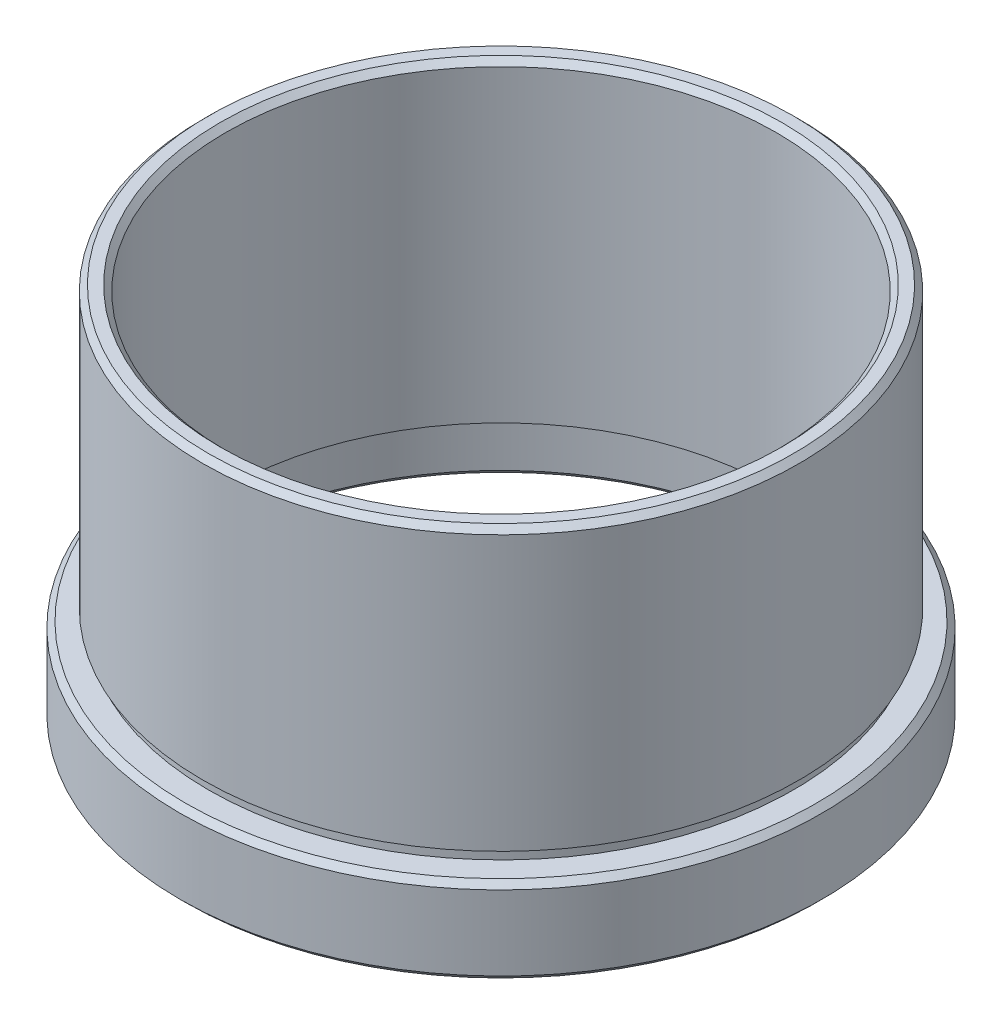
ISO-10303-21;
HEADER;
FILE_DESCRIPTION(('STEP AP214'),'2;1');
FILE_NAME('part.step','',(''),(''),'','','');
FILE_SCHEMA(('AUTOMOTIVE_DESIGN { 1 0 10303 214 1 1 1 1 }'));
ENDSEC;
DATA;
#1=APPLICATION_CONTEXT('core data for automotive mechanical design processes');
#2=APPLICATION_PROTOCOL_DEFINITION('international standard','automotive_design',2000,#1);
#3=PRODUCT_CONTEXT('',#1,'mechanical');
#4=PRODUCT('Part','Part','',(#3));
#5=PRODUCT_RELATED_PRODUCT_CATEGORY('part','',(#4));
#6=PRODUCT_DEFINITION_FORMATION('','',#4);
#7=PRODUCT_DEFINITION_CONTEXT('part definition',#1,'design');
#8=PRODUCT_DEFINITION('design','',#6,#7);
#9=PRODUCT_DEFINITION_SHAPE('','',#8);
#10=(LENGTH_UNIT() NAMED_UNIT(*) SI_UNIT(.MILLI.,.METRE.));
#11=(NAMED_UNIT(*) PLANE_ANGLE_UNIT() SI_UNIT($,.RADIAN.));
#12=(NAMED_UNIT(*) SI_UNIT($,.STERADIAN.) SOLID_ANGLE_UNIT());
#13=UNCERTAINTY_MEASURE_WITH_UNIT(LENGTH_MEASURE(1.E-05),#10,'distance_accuracy_value','');
#14=(GEOMETRIC_REPRESENTATION_CONTEXT(3) GLOBAL_UNCERTAINTY_ASSIGNED_CONTEXT((#13)) GLOBAL_UNIT_ASSIGNED_CONTEXT((#10,
#11,#12)) REPRESENTATION_CONTEXT('',''));
#15=CARTESIAN_POINT('',(0.,0.,0.));
#16=DIRECTION('',(0.,0.,1.));
#17=DIRECTION('',(1.,0.,0.));
#18=AXIS2_PLACEMENT_3D('',#15,#16,#17);
#19=CARTESIAN_POINT('',(26.,2.64285417456689,0.));
#20=DIRECTION('',(0.,1.,0.));
#21=DIRECTION('',(0.,0.,1.));
#22=AXIS2_PLACEMENT_3D('',#19,#20,#21);
#23=PLANE('',#22);
#24=CARTESIAN_POINT('',(0.,2.6428541745669,0.));
#25=DIRECTION('',(0.,1.,0.));
#26=DIRECTION('',(0.,0.,1.));
#27=AXIS2_PLACEMENT_3D('',#24,#25,#26);
#28=CIRCLE('',#27,26.);
#29=CARTESIAN_POINT('',(0.,2.6428541745669,26.));
#30=VERTEX_POINT('',#29);
#31=EDGE_CURVE('E12',#30,#30,#28,.T.);
#32=ORIENTED_EDGE('',*,*,#31,.F.);
#33=EDGE_LOOP('',(#32));
#34=FACE_BOUND('',#33,.T.);
#35=CARTESIAN_POINT('',(0.,2.6428541745669,0.));
#36=DIRECTION('',(0.,1.,0.));
#37=DIRECTION('',(0.,0.,1.));
#38=AXIS2_PLACEMENT_3D('',#35,#36,#37);
#39=CIRCLE('',#38,25.5);
#40=CARTESIAN_POINT('',(0.,2.6428541745669,25.5));
#41=VERTEX_POINT('',#40);
#42=EDGE_CURVE('E106',#41,#41,#39,.T.);
#43=ORIENTED_EDGE('',*,*,#42,.T.);
#44=EDGE_LOOP('',(#43));
#45=FACE_BOUND('',#44,.T.);
#46=ADVANCED_FACE('F51',(#34,#45),#23,.F.);
#47=CARTESIAN_POINT('',(0.,44.5985977452931,0.));
#48=DIRECTION('',(0.,1.,0.));
#49=DIRECTION('',(0.,0.,1.));
#50=AXIS2_PLACEMENT_3D('',#47,#48,#49);
#51=CYLINDRICAL_SURFACE('',#50,26.);
#52=CARTESIAN_POINT('',(0.,26.5428541745669,0.));
#53=DIRECTION('',(0.,1.,0.));
#54=DIRECTION('',(0.,0.,1.));
#55=AXIS2_PLACEMENT_3D('',#52,#53,#54);
#56=CIRCLE('',#55,26.);
#57=CARTESIAN_POINT('',(0.,26.5428541745669,26.));
#58=VERTEX_POINT('',#57);
#59=EDGE_CURVE('E57',#58,#58,#56,.T.);
#60=ORIENTED_EDGE('',*,*,#59,.F.);
#61=EDGE_LOOP('',(#60));
#62=FACE_BOUND('',#61,.T.);
#63=ORIENTED_EDGE('',*,*,#31,.T.);
#64=EDGE_LOOP('',(#63));
#65=FACE_BOUND('',#64,.T.);
#66=ADVANCED_FACE('F197',(#62,#65),#51,.T.);
#67=CARTESIAN_POINT('',(0.,26.5428541745669,0.));
#68=DIRECTION('',(0.,-1.,0.));
#69=DIRECTION('',(0.,0.,-1.));
#70=AXIS2_PLACEMENT_3D('',#67,#68,#69);
#71=CONICAL_SURFACE('',#70,26.,0.785398163397448);
#72=CARTESIAN_POINT('',(0.,27.0428541745669,0.));
#73=DIRECTION('',(0.,1.,0.));
#74=DIRECTION('',(0.,0.,1.));
#75=AXIS2_PLACEMENT_3D('',#72,#73,#74);
#76=CIRCLE('',#75,25.5);
#77=CARTESIAN_POINT('',(0.,27.0428541745669,25.5));
#78=VERTEX_POINT('',#77);
#79=EDGE_CURVE('E61',#78,#78,#76,.T.);
#80=ORIENTED_EDGE('',*,*,#79,.F.);
#81=EDGE_LOOP('',(#80));
#82=FACE_BOUND('',#81,.T.);
#83=ORIENTED_EDGE('',*,*,#59,.T.);
#84=EDGE_LOOP('',(#83));
#85=FACE_BOUND('',#84,.T.);
#86=ADVANCED_FACE('F192',(#82,#85),#71,.T.);
#87=CARTESIAN_POINT('',(24.5,27.0428541745669,0.));
#88=DIRECTION('',(0.,-1.,0.));
#89=DIRECTION('',(0.,0.,-1.));
#90=AXIS2_PLACEMENT_3D('',#87,#88,#89);
#91=PLANE('',#90);
#92=CARTESIAN_POINT('',(0.,27.0428541745669,0.));
#93=DIRECTION('',(0.,1.,0.));
#94=DIRECTION('',(0.,0.,1.));
#95=AXIS2_PLACEMENT_3D('',#92,#93,#94);
#96=CIRCLE('',#95,24.5);
#97=CARTESIAN_POINT('',(0.,27.0428541745669,24.5));
#98=VERTEX_POINT('',#97);
#99=EDGE_CURVE('E65',#98,#98,#96,.T.);
#100=ORIENTED_EDGE('',*,*,#99,.F.);
#101=EDGE_LOOP('',(#100));
#102=FACE_BOUND('',#101,.T.);
#103=ORIENTED_EDGE('',*,*,#79,.T.);
#104=EDGE_LOOP('',(#103));
#105=FACE_BOUND('',#104,.T.);
#106=ADVANCED_FACE('F186',(#102,#105),#91,.F.);
#107=CARTESIAN_POINT('',(0.,27.0428541745669,0.));
#108=DIRECTION('',(0.,1.,0.));
#109=DIRECTION('',(0.,0.,1.));
#110=AXIS2_PLACEMENT_3D('',#107,#108,#109);
#111=CONICAL_SURFACE('',#110,24.5,0.785398163397448);
#112=CARTESIAN_POINT('',(0.,26.5428541745669,0.));
#113=DIRECTION('',(0.,1.,0.));
#114=DIRECTION('',(0.,0.,1.));
#115=AXIS2_PLACEMENT_3D('',#112,#113,#114);
#116=CIRCLE('',#115,24.);
#117=CARTESIAN_POINT('',(0.,26.5428541745669,24.));
#118=VERTEX_POINT('',#117);
#119=EDGE_CURVE('E70',#118,#118,#116,.T.);
#120=ORIENTED_EDGE('',*,*,#119,.F.);
#121=EDGE_LOOP('',(#120));
#122=FACE_BOUND('',#121,.T.);
#123=ORIENTED_EDGE('',*,*,#99,.T.);
#124=EDGE_LOOP('',(#123));
#125=FACE_BOUND('',#124,.T.);
#126=ADVANCED_FACE('F180',(#122,#125),#111,.F.);
#127=CARTESIAN_POINT('',(0.,44.5985977452931,0.));
#128=DIRECTION('',(0.,1.,0.));
#129=DIRECTION('',(0.,0.,1.));
#130=AXIS2_PLACEMENT_3D('',#127,#128,#129);
#131=CYLINDRICAL_SURFACE('',#130,24.);
#132=CARTESIAN_POINT('',(0.,-0.357145825433107,0.));
#133=DIRECTION('',(0.,1.,0.));
#134=DIRECTION('',(0.,0.,1.));
#135=AXIS2_PLACEMENT_3D('',#132,#133,#134);
#136=CIRCLE('',#135,24.);
#137=CARTESIAN_POINT('',(0.,-0.357145825433107,24.));
#138=VERTEX_POINT('',#137);
#139=EDGE_CURVE('E73',#138,#138,#136,.T.);
#140=ORIENTED_EDGE('',*,*,#139,.F.);
#141=EDGE_LOOP('',(#140));
#142=FACE_BOUND('',#141,.T.);
#143=ORIENTED_EDGE('',*,*,#119,.T.);
#144=EDGE_LOOP('',(#143));
#145=FACE_BOUND('',#144,.T.);
#146=ADVANCED_FACE('F174',(#142,#145),#131,.F.);
#147=CARTESIAN_POINT('',(26.1,-0.357145825433106,0.));
#148=DIRECTION('',(0.,1.,0.));
#149=DIRECTION('',(0.,0.,1.));
#150=AXIS2_PLACEMENT_3D('',#147,#148,#149);
#151=PLANE('',#150);
#152=CARTESIAN_POINT('',(0.,-0.357145825433107,0.));
#153=DIRECTION('',(0.,1.,0.));
#154=DIRECTION('',(0.,0.,1.));
#155=AXIS2_PLACEMENT_3D('',#152,#153,#154);
#156=CIRCLE('',#155,26.1);
#157=CARTESIAN_POINT('',(0.,-0.357145825433107,26.1));
#158=VERTEX_POINT('',#157);
#159=EDGE_CURVE('E76',#158,#158,#156,.T.);
#160=ORIENTED_EDGE('',*,*,#159,.F.);
#161=EDGE_LOOP('',(#160));
#162=FACE_BOUND('',#161,.T.);
#163=ORIENTED_EDGE('',*,*,#139,.T.);
#164=EDGE_LOOP('',(#163));
#165=FACE_BOUND('',#164,.T.);
#166=ADVANCED_FACE('F168',(#162,#165),#151,.F.);
#167=CARTESIAN_POINT('',(0.,44.5985977452931,0.));
#168=DIRECTION('',(0.,1.,0.));
#169=DIRECTION('',(0.,0.,1.));
#170=AXIS2_PLACEMENT_3D('',#167,#168,#169);
#171=CYLINDRICAL_SURFACE('',#170,26.1);
#172=CARTESIAN_POINT('',(0.,-1.35714582543311,0.));
#173=DIRECTION('',(0.,1.,0.));
#174=DIRECTION('',(0.,0.,1.));
#175=AXIS2_PLACEMENT_3D('',#172,#173,#174);
#176=CIRCLE('',#175,26.1);
#177=CARTESIAN_POINT('',(0.,-1.35714582543311,26.1));
#178=VERTEX_POINT('',#177);
#179=EDGE_CURVE('E79',#178,#178,#176,.T.);
#180=ORIENTED_EDGE('',*,*,#179,.F.);
#181=EDGE_LOOP('',(#180));
#182=FACE_BOUND('',#181,.T.);
#183=ORIENTED_EDGE('',*,*,#159,.T.);
#184=EDGE_LOOP('',(#183));
#185=FACE_BOUND('',#184,.T.);
#186=ADVANCED_FACE('F162',(#182,#185),#171,.F.);
#187=CARTESIAN_POINT('',(26.,-1.35714582543311,0.));
#188=DIRECTION('',(0.,-1.,0.));
#189=DIRECTION('',(0.,0.,-1.));
#190=AXIS2_PLACEMENT_3D('',#187,#188,#189);
#191=PLANE('',#190);
#192=CARTESIAN_POINT('',(0.,-1.35714582543311,0.));
#193=DIRECTION('',(0.,1.,0.));
#194=DIRECTION('',(0.,0.,1.));
#195=AXIS2_PLACEMENT_3D('',#192,#193,#194);
#196=CIRCLE('',#195,26.);
#197=CARTESIAN_POINT('',(0.,-1.35714582543311,26.));
#198=VERTEX_POINT('',#197);
#199=EDGE_CURVE('E82',#198,#198,#196,.T.);
#200=ORIENTED_EDGE('',*,*,#199,.F.);
#201=EDGE_LOOP('',(#200));
#202=FACE_BOUND('',#201,.T.);
#203=ORIENTED_EDGE('',*,*,#179,.T.);
#204=EDGE_LOOP('',(#203));
#205=FACE_BOUND('',#204,.T.);
#206=ADVANCED_FACE('F156',(#202,#205),#191,.F.);
#207=CARTESIAN_POINT('',(0.,44.5985977452931,0.));
#208=DIRECTION('',(0.,1.,0.));
#209=DIRECTION('',(0.,0.,1.));
#210=AXIS2_PLACEMENT_3D('',#207,#208,#209);
#211=CYLINDRICAL_SURFACE('',#210,26.);
#212=CARTESIAN_POINT('',(0.,-5.3571458254331,0.));
#213=DIRECTION('',(0.,1.,0.));
#214=DIRECTION('',(0.,0.,1.));
#215=AXIS2_PLACEMENT_3D('',#212,#213,#214);
#216=CIRCLE('',#215,26.);
#217=CARTESIAN_POINT('',(0.,-5.3571458254331,26.));
#218=VERTEX_POINT('',#217);
#219=EDGE_CURVE('E85',#218,#218,#216,.T.);
#220=ORIENTED_EDGE('',*,*,#219,.F.);
#221=EDGE_LOOP('',(#220));
#222=FACE_BOUND('',#221,.T.);
#223=ORIENTED_EDGE('',*,*,#199,.T.);
#224=EDGE_LOOP('',(#223));
#225=FACE_BOUND('',#224,.T.);
#226=ADVANCED_FACE('F150',(#222,#225),#211,.F.);
#227=CARTESIAN_POINT('',(0.,-5.3571458254331,0.));
#228=DIRECTION('',(0.,-1.,0.));
#229=DIRECTION('',(0.,0.,-1.));
#230=AXIS2_PLACEMENT_3D('',#227,#228,#229);
#231=CONICAL_SURFACE('',#230,26.,0.785398163397448);
#232=CARTESIAN_POINT('',(0.,-5.85714582543311,0.));
#233=DIRECTION('',(0.,1.,0.));
#234=DIRECTION('',(0.,0.,1.));
#235=AXIS2_PLACEMENT_3D('',#232,#233,#234);
#236=CIRCLE('',#235,26.5);
#237=CARTESIAN_POINT('',(0.,-5.85714582543311,26.5));
#238=VERTEX_POINT('',#237);
#239=EDGE_CURVE('E88',#238,#238,#236,.T.);
#240=ORIENTED_EDGE('',*,*,#239,.F.);
#241=EDGE_LOOP('',(#240));
#242=FACE_BOUND('',#241,.T.);
#243=ORIENTED_EDGE('',*,*,#219,.T.);
#244=EDGE_LOOP('',(#243));
#245=FACE_BOUND('',#244,.T.);
#246=ADVANCED_FACE('F144',(#242,#245),#231,.F.);
#247=CARTESIAN_POINT('',(27.5,-5.85714582543311,0.));
#248=DIRECTION('',(0.,1.,0.));
#249=DIRECTION('',(0.,0.,1.));
#250=AXIS2_PLACEMENT_3D('',#247,#248,#249);
#251=PLANE('',#250);
#252=CARTESIAN_POINT('',(0.,-5.85714582543311,0.));
#253=DIRECTION('',(0.,1.,0.));
#254=DIRECTION('',(0.,0.,1.));
#255=AXIS2_PLACEMENT_3D('',#252,#253,#254);
#256=CIRCLE('',#255,27.5);
#257=CARTESIAN_POINT('',(0.,-5.85714582543311,27.5));
#258=VERTEX_POINT('',#257);
#259=EDGE_CURVE('E91',#258,#258,#256,.T.);
#260=ORIENTED_EDGE('',*,*,#259,.F.);
#261=EDGE_LOOP('',(#260));
#262=FACE_BOUND('',#261,.T.);
#263=ORIENTED_EDGE('',*,*,#239,.T.);
#264=EDGE_LOOP('',(#263));
#265=FACE_BOUND('',#264,.T.);
#266=ADVANCED_FACE('F138',(#262,#265),#251,.F.);
#267=CARTESIAN_POINT('',(0.,-5.85714582543311,0.));
#268=DIRECTION('',(0.,1.,0.));
#269=DIRECTION('',(0.,0.,1.));
#270=AXIS2_PLACEMENT_3D('',#267,#268,#269);
#271=CONICAL_SURFACE('',#270,27.5,0.785398163397448);
#272=CARTESIAN_POINT('',(0.,-5.3571458254331,0.));
#273=DIRECTION('',(0.,1.,0.));
#274=DIRECTION('',(0.,0.,1.));
#275=AXIS2_PLACEMENT_3D('',#272,#273,#274);
#276=CIRCLE('',#275,28.);
#277=CARTESIAN_POINT('',(0.,-5.3571458254331,28.));
#278=VERTEX_POINT('',#277);
#279=EDGE_CURVE('E94',#278,#278,#276,.T.);
#280=ORIENTED_EDGE('',*,*,#279,.F.);
#281=EDGE_LOOP('',(#280));
#282=FACE_BOUND('',#281,.T.);
#283=ORIENTED_EDGE('',*,*,#259,.T.);
#284=EDGE_LOOP('',(#283));
#285=FACE_BOUND('',#284,.T.);
#286=ADVANCED_FACE('F132',(#282,#285),#271,.T.);
#287=CARTESIAN_POINT('',(0.,44.5985977452931,0.));
#288=DIRECTION('',(0.,1.,0.));
#289=DIRECTION('',(0.,0.,1.));
#290=AXIS2_PLACEMENT_3D('',#287,#288,#289);
#291=CYLINDRICAL_SURFACE('',#290,28.);
#292=CARTESIAN_POINT('',(0.,1.14285417456689,0.));
#293=DIRECTION('',(0.,1.,0.));
#294=DIRECTION('',(0.,0.,1.));
#295=AXIS2_PLACEMENT_3D('',#292,#293,#294);
#296=CIRCLE('',#295,28.);
#297=CARTESIAN_POINT('',(0.,1.14285417456689,28.));
#298=VERTEX_POINT('',#297);
#299=EDGE_CURVE('E97',#298,#298,#296,.T.);
#300=ORIENTED_EDGE('',*,*,#299,.F.);
#301=EDGE_LOOP('',(#300));
#302=FACE_BOUND('',#301,.T.);
#303=ORIENTED_EDGE('',*,*,#279,.T.);
#304=EDGE_LOOP('',(#303));
#305=FACE_BOUND('',#304,.T.);
#306=ADVANCED_FACE('F126',(#302,#305),#291,.T.);
#307=CARTESIAN_POINT('',(0.,1.14285417456689,0.));
#308=DIRECTION('',(0.,-1.,0.));
#309=DIRECTION('',(0.,0.,-1.));
#310=AXIS2_PLACEMENT_3D('',#307,#308,#309);
#311=CONICAL_SURFACE('',#310,28.,0.785398163397448);
#312=CARTESIAN_POINT('',(0.,1.64285417456689,0.));
#313=DIRECTION('',(0.,1.,0.));
#314=DIRECTION('',(0.,0.,1.));
#315=AXIS2_PLACEMENT_3D('',#312,#313,#314);
#316=CIRCLE('',#315,27.5);
#317=CARTESIAN_POINT('',(0.,1.64285417456689,27.5));
#318=VERTEX_POINT('',#317);
#319=EDGE_CURVE('E100',#318,#318,#316,.T.);
#320=ORIENTED_EDGE('',*,*,#319,.F.);
#321=EDGE_LOOP('',(#320));
#322=FACE_BOUND('',#321,.T.);
#323=ORIENTED_EDGE('',*,*,#299,.T.);
#324=EDGE_LOOP('',(#323));
#325=FACE_BOUND('',#324,.T.);
#326=ADVANCED_FACE('F120',(#322,#325),#311,.T.);
#327=CARTESIAN_POINT('',(25.5,1.64285417456689,0.));
#328=DIRECTION('',(0.,-1.,0.));
#329=DIRECTION('',(0.,0.,-1.));
#330=AXIS2_PLACEMENT_3D('',#327,#328,#329);
#331=PLANE('',#330);
#332=CARTESIAN_POINT('',(0.,1.64285417456689,0.));
#333=DIRECTION('',(0.,1.,0.));
#334=DIRECTION('',(0.,0.,1.));
#335=AXIS2_PLACEMENT_3D('',#332,#333,#334);
#336=CIRCLE('',#335,25.5);
#337=CARTESIAN_POINT('',(0.,1.64285417456689,25.5));
#338=VERTEX_POINT('',#337);
#339=EDGE_CURVE('E103',#338,#338,#336,.T.);
#340=ORIENTED_EDGE('',*,*,#339,.F.);
#341=EDGE_LOOP('',(#340));
#342=FACE_BOUND('',#341,.T.);
#343=ORIENTED_EDGE('',*,*,#319,.T.);
#344=EDGE_LOOP('',(#343));
#345=FACE_BOUND('',#344,.T.);
#346=ADVANCED_FACE('F114',(#342,#345),#331,.F.);
#347=CARTESIAN_POINT('',(0.,44.5985977452931,0.));
#348=DIRECTION('',(0.,1.,0.));
#349=DIRECTION('',(0.,0.,1.));
#350=AXIS2_PLACEMENT_3D('',#347,#348,#349);
#351=CYLINDRICAL_SURFACE('',#350,25.5);
#352=ORIENTED_EDGE('',*,*,#42,.F.);
#353=EDGE_LOOP('',(#352));
#354=FACE_BOUND('',#353,.T.);
#355=ORIENTED_EDGE('',*,*,#339,.T.);
#356=EDGE_LOOP('',(#355));
#357=FACE_BOUND('',#356,.T.);
#358=ADVANCED_FACE('F111',(#354,#357),#351,.T.);
#359=CLOSED_SHELL('',(#46,#66,#86,#106,#126,#146,#166,#186,#206,#226,#246,#266,#286,#306,#326,
#346,#358));
#360=MANIFOLD_SOLID_BREP('B2',#359);
#361=ADVANCED_BREP_SHAPE_REPRESENTATION('',(#18,#360),#14);
#362=SHAPE_DEFINITION_REPRESENTATION(#9,#361);
ENDSEC;
END-ISO-10303-21;
